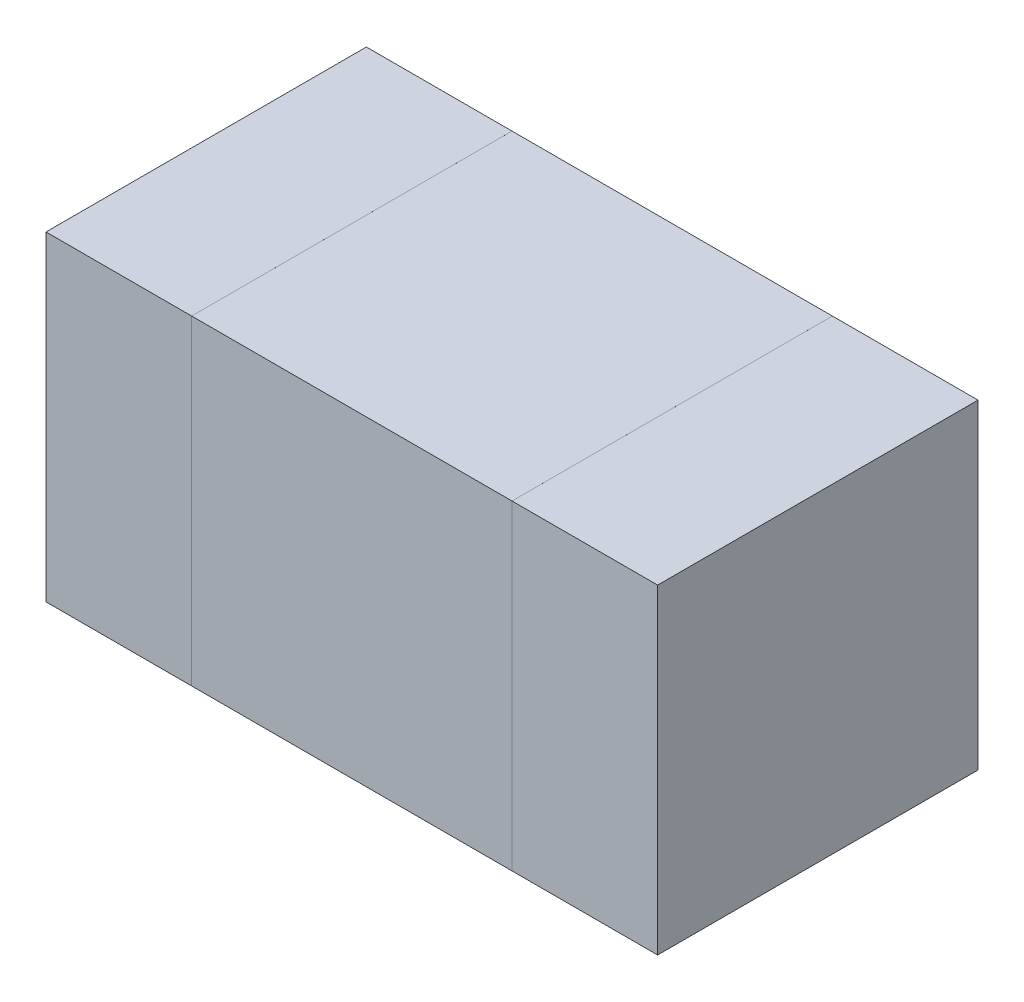
ISO-10303-21;
HEADER;
FILE_DESCRIPTION(('STEP AP214'),'2;1');
FILE_NAME('part.step','',(''),(''),'','','');
FILE_SCHEMA(('AUTOMOTIVE_DESIGN { 1 0 10303 214 1 1 1 1 }'));
ENDSEC;
DATA;
#1=APPLICATION_CONTEXT('core data for automotive mechanical design processes');
#2=APPLICATION_PROTOCOL_DEFINITION('international standard','automotive_design',2000,#1);
#3=PRODUCT_CONTEXT('',#1,'mechanical');
#4=PRODUCT('Part','Part','',(#3));
#5=PRODUCT_RELATED_PRODUCT_CATEGORY('part','',(#4));
#6=PRODUCT_DEFINITION_FORMATION('','',#4);
#7=PRODUCT_DEFINITION_CONTEXT('part definition',#1,'design');
#8=PRODUCT_DEFINITION('design','',#6,#7);
#9=PRODUCT_DEFINITION_SHAPE('','',#8);
#10=(LENGTH_UNIT() NAMED_UNIT(*) SI_UNIT(.MILLI.,.METRE.));
#11=(NAMED_UNIT(*) PLANE_ANGLE_UNIT() SI_UNIT($,.RADIAN.));
#12=(NAMED_UNIT(*) SI_UNIT($,.STERADIAN.) SOLID_ANGLE_UNIT());
#13=UNCERTAINTY_MEASURE_WITH_UNIT(LENGTH_MEASURE(1.E-05),#10,'distance_accuracy_value','');
#14=(GEOMETRIC_REPRESENTATION_CONTEXT(3) GLOBAL_UNCERTAINTY_ASSIGNED_CONTEXT((#13)) GLOBAL_UNIT_ASSIGNED_CONTEXT((#10,
#11,#12)) REPRESENTATION_CONTEXT('',''));
#15=CARTESIAN_POINT('',(0.,0.,0.));
#16=DIRECTION('',(0.,0.,1.));
#17=DIRECTION('',(1.,0.,0.));
#18=AXIS2_PLACEMENT_3D('',#15,#16,#17);
#19=CARTESIAN_POINT('',(0.984990592773,6.634998946074,0.32999934));
#20=DIRECTION('',(0.,0.,-1.));
#21=DIRECTION('',(0.,-1.,0.));
#22=AXIS2_PLACEMENT_3D('',#19,#20,#21);
#23=PLANE('',#22);
#24=DIRECTION('',(0.,1.,0.));
#25=VECTOR('',#24,1.);
#26=CARTESIAN_POINT('',(0.984990592773,6.634998946074,0.32999934));
#27=LINE('',#26,#25);
#28=CARTESIAN_POINT('',(0.984990592773,6.634998946074,0.32999934));
#29=VERTEX_POINT('',#28);
#30=CARTESIAN_POINT('',(0.984990592773,6.965000826074,0.32999934));
#31=VERTEX_POINT('',#30);
#32=EDGE_CURVE('P0_E80',#29,#31,#27,.T.);
#33=ORIENTED_EDGE('',*,*,#32,.T.);
#34=DIRECTION('',(-1.,0.,0.));
#35=VECTOR('',#34,1.);
#36=CARTESIAN_POINT('',(0.984990592773,6.965000826074,0.32999934));
#37=LINE('',#36,#35);
#38=CARTESIAN_POINT('',(0.834988352773,6.965000826074,0.32999934));
#39=VERTEX_POINT('',#38);
#40=EDGE_CURVE('P0_E102',#31,#39,#37,.T.);
#41=ORIENTED_EDGE('',*,*,#40,.T.);
#42=DIRECTION('',(0.,-1.,0.));
#43=VECTOR('',#42,1.);
#44=CARTESIAN_POINT('',(0.834988352773,6.965000826074,0.32999934));
#45=LINE('',#44,#43);
#46=CARTESIAN_POINT('',(0.834988352773,6.634998946074,0.32999934));
#47=VERTEX_POINT('',#46);
#48=EDGE_CURVE('P0_E73',#39,#47,#45,.T.);
#49=ORIENTED_EDGE('',*,*,#48,.T.);
#50=DIRECTION('',(1.,0.,0.));
#51=VECTOR('',#50,1.);
#52=CARTESIAN_POINT('',(0.834988352773,6.634998946074,0.32999934));
#53=LINE('',#52,#51);
#54=EDGE_CURVE('P0_E11',#47,#29,#53,.T.);
#55=ORIENTED_EDGE('',*,*,#54,.T.);
#56=EDGE_LOOP('',(#33,#41,#49,#55));
#57=FACE_BOUND('',#56,.T.);
#58=ADVANCED_FACE('P0_F17',(#57),#23,.F.);
#59=CARTESIAN_POINT('',(0.984990592773,6.634998946074,0.));
#60=DIRECTION('',(0.,0.,-1.));
#61=DIRECTION('',(0.,-1.,0.));
#62=AXIS2_PLACEMENT_3D('',#59,#60,#61);
#63=PLANE('',#62);
#64=DIRECTION('',(1.,0.,0.));
#65=VECTOR('',#64,1.);
#66=CARTESIAN_POINT('',(0.834988352773,6.634998946074,0.));
#67=LINE('',#66,#65);
#68=CARTESIAN_POINT('',(0.834988352773,6.634998946074,0.));
#69=VERTEX_POINT('',#68);
#70=CARTESIAN_POINT('',(0.984990592773,6.634998946074,0.));
#71=VERTEX_POINT('',#70);
#72=EDGE_CURVE('P0_E20',#69,#71,#67,.T.);
#73=ORIENTED_EDGE('',*,*,#72,.F.);
#74=DIRECTION('',(0.,-1.,0.));
#75=VECTOR('',#74,1.);
#76=CARTESIAN_POINT('',(0.834988352773,6.965000826074,0.));
#77=LINE('',#76,#75);
#78=CARTESIAN_POINT('',(0.834988352773,6.965000826074,0.));
#79=VERTEX_POINT('',#78);
#80=EDGE_CURVE('P0_E106',#79,#69,#77,.T.);
#81=ORIENTED_EDGE('',*,*,#80,.F.);
#82=DIRECTION('',(-1.,0.,0.));
#83=VECTOR('',#82,1.);
#84=CARTESIAN_POINT('',(0.984990592773,6.965000826074,0.));
#85=LINE('',#84,#83);
#86=CARTESIAN_POINT('',(0.984990592773,6.965000826074,0.));
#87=VERTEX_POINT('',#86);
#88=EDGE_CURVE('P0_E82',#87,#79,#85,.T.);
#89=ORIENTED_EDGE('',*,*,#88,.F.);
#90=DIRECTION('',(0.,1.,0.));
#91=VECTOR('',#90,1.);
#92=CARTESIAN_POINT('',(0.984990592773,6.634998946074,0.));
#93=LINE('',#92,#91);
#94=EDGE_CURVE('P0_E78',#71,#87,#93,.T.);
#95=ORIENTED_EDGE('',*,*,#94,.F.);
#96=EDGE_LOOP('',(#73,#81,#89,#95));
#97=FACE_BOUND('',#96,.T.);
#98=ADVANCED_FACE('P0_F84',(#97),#63,.T.);
#99=CARTESIAN_POINT('',(0.834988352773,6.634998946074,0.));
#100=DIRECTION('',(0.,1.,0.));
#101=DIRECTION('',(1.,0.,0.));
#102=AXIS2_PLACEMENT_3D('',#99,#100,#101);
#103=PLANE('',#102);
#104=ORIENTED_EDGE('',*,*,#72,.T.);
#105=DIRECTION('',(0.,0.,1.));
#106=VECTOR('',#105,1.);
#107=CARTESIAN_POINT('',(0.984990592773,6.634998946074,0.));
#108=LINE('',#107,#106);
#109=EDGE_CURVE('P0_E65',#71,#29,#108,.T.);
#110=ORIENTED_EDGE('',*,*,#109,.T.);
#111=ORIENTED_EDGE('',*,*,#54,.F.);
#112=DIRECTION('',(0.,0.,1.));
#113=VECTOR('',#112,1.);
#114=CARTESIAN_POINT('',(0.834988352773,6.634998946074,0.));
#115=LINE('',#114,#113);
#116=EDGE_CURVE('P0_E68',#69,#47,#115,.T.);
#117=ORIENTED_EDGE('',*,*,#116,.F.);
#118=EDGE_LOOP('',(#104,#110,#111,#117));
#119=FACE_BOUND('',#118,.T.);
#120=ADVANCED_FACE('P0_F64',(#119),#103,.F.);
#121=CARTESIAN_POINT('',(0.834988352773,6.965000826074,0.));
#122=DIRECTION('',(1.,0.,0.));
#123=DIRECTION('',(0.,1.,0.));
#124=AXIS2_PLACEMENT_3D('',#121,#122,#123);
#125=PLANE('',#124);
#126=ORIENTED_EDGE('',*,*,#80,.T.);
#127=ORIENTED_EDGE('',*,*,#116,.T.);
#128=ORIENTED_EDGE('',*,*,#48,.F.);
#129=DIRECTION('',(0.,0.,1.));
#130=VECTOR('',#129,1.);
#131=CARTESIAN_POINT('',(0.834988352773,6.965000826074,0.));
#132=LINE('',#131,#130);
#133=EDGE_CURVE('P0_E97',#79,#39,#132,.T.);
#134=ORIENTED_EDGE('',*,*,#133,.F.);
#135=EDGE_LOOP('',(#126,#127,#128,#134));
#136=FACE_BOUND('',#135,.T.);
#137=ADVANCED_FACE('P0_F115',(#136),#125,.F.);
#138=CARTESIAN_POINT('',(0.984990592773,6.965000826074,0.));
#139=DIRECTION('',(0.,-1.,0.));
#140=DIRECTION('',(0.,0.,-1.));
#141=AXIS2_PLACEMENT_3D('',#138,#139,#140);
#142=PLANE('',#141);
#143=ORIENTED_EDGE('',*,*,#88,.T.);
#144=ORIENTED_EDGE('',*,*,#133,.T.);
#145=ORIENTED_EDGE('',*,*,#40,.F.);
#146=DIRECTION('',(0.,0.,1.));
#147=VECTOR('',#146,1.);
#148=CARTESIAN_POINT('',(0.984990592773,6.965000826074,0.));
#149=LINE('',#148,#147);
#150=EDGE_CURVE('P0_E88',#87,#31,#149,.T.);
#151=ORIENTED_EDGE('',*,*,#150,.F.);
#152=EDGE_LOOP('',(#143,#144,#145,#151));
#153=FACE_BOUND('',#152,.T.);
#154=ADVANCED_FACE('P0_F117',(#153),#142,.F.);
#155=CARTESIAN_POINT('',(0.984990592773,6.634998946074,0.));
#156=DIRECTION('',(-1.,0.,0.));
#157=DIRECTION('',(0.,0.,1.));
#158=AXIS2_PLACEMENT_3D('',#155,#156,#157);
#159=PLANE('',#158);
#160=ORIENTED_EDGE('',*,*,#94,.T.);
#161=ORIENTED_EDGE('',*,*,#150,.T.);
#162=ORIENTED_EDGE('',*,*,#32,.F.);
#163=ORIENTED_EDGE('',*,*,#109,.F.);
#164=EDGE_LOOP('',(#160,#161,#162,#163));
#165=FACE_BOUND('',#164,.T.);
#166=ADVANCED_FACE('P0_F76',(#165),#159,.F.);
#167=CLOSED_SHELL('',(#58,#98,#120,#137,#154,#166));
#168=MANIFOLD_SOLID_BREP('P0_B1',#167);
#169=CARTESIAN_POINT('',(1.465001579102,6.634998946074,0.32999934));
#170=DIRECTION('',(0.,0.,-1.));
#171=DIRECTION('',(0.,-1.,0.));
#172=AXIS2_PLACEMENT_3D('',#169,#170,#171);
#173=PLANE('',#172);
#174=DIRECTION('',(0.,1.,0.));
#175=VECTOR('',#174,1.);
#176=CARTESIAN_POINT('',(1.465001579102,6.634998946074,0.32999934));
#177=LINE('',#176,#175);
#178=CARTESIAN_POINT('',(1.465001579102,6.634998946074,0.32999934));
#179=VERTEX_POINT('',#178);
#180=CARTESIAN_POINT('',(1.465001579102,6.965000826074,0.32999934));
#181=VERTEX_POINT('',#180);
#182=EDGE_CURVE('P1_E84',#179,#181,#177,.T.);
#183=ORIENTED_EDGE('',*,*,#182,.T.);
#184=DIRECTION('',(-1.,0.,0.));
#185=VECTOR('',#184,1.);
#186=CARTESIAN_POINT('',(1.465001579102,6.965000826074,0.32999934));
#187=LINE('',#186,#185);
#188=CARTESIAN_POINT('',(1.314999339102,6.965000826074,0.32999934));
#189=VERTEX_POINT('',#188);
#190=EDGE_CURVE('P1_E70',#181,#189,#187,.T.);
#191=ORIENTED_EDGE('',*,*,#190,.T.);
#192=DIRECTION('',(0.,-1.,0.));
#193=VECTOR('',#192,1.);
#194=CARTESIAN_POINT('',(1.314999339102,6.965000826074,0.32999934));
#195=LINE('',#194,#193);
#196=CARTESIAN_POINT('',(1.314999339102,6.634998946074,0.32999934));
#197=VERTEX_POINT('',#196);
#198=EDGE_CURVE('P1_E111',#189,#197,#195,.T.);
#199=ORIENTED_EDGE('',*,*,#198,.T.);
#200=DIRECTION('',(1.,0.,0.));
#201=VECTOR('',#200,1.);
#202=CARTESIAN_POINT('',(1.314999339102,6.634998946074,0.32999934));
#203=LINE('',#202,#201);
#204=EDGE_CURVE('P1_E11',#197,#179,#203,.T.);
#205=ORIENTED_EDGE('',*,*,#204,.T.);
#206=EDGE_LOOP('',(#183,#191,#199,#205));
#207=FACE_BOUND('',#206,.T.);
#208=ADVANCED_FACE('P1_F17',(#207),#173,.F.);
#209=CARTESIAN_POINT('',(1.465001579102,6.634998946074,0.));
#210=DIRECTION('',(0.,0.,-1.));
#211=DIRECTION('',(0.,-1.,0.));
#212=AXIS2_PLACEMENT_3D('',#209,#210,#211);
#213=PLANE('',#212);
#214=DIRECTION('',(1.,0.,0.));
#215=VECTOR('',#214,1.);
#216=CARTESIAN_POINT('',(1.314999339102,6.634998946074,0.));
#217=LINE('',#216,#215);
#218=CARTESIAN_POINT('',(1.314999339102,6.634998946074,0.));
#219=VERTEX_POINT('',#218);
#220=CARTESIAN_POINT('',(1.465001579102,6.634998946074,0.));
#221=VERTEX_POINT('',#220);
#222=EDGE_CURVE('P1_E25',#219,#221,#217,.T.);
#223=ORIENTED_EDGE('',*,*,#222,.F.);
#224=DIRECTION('',(0.,-1.,0.));
#225=VECTOR('',#224,1.);
#226=CARTESIAN_POINT('',(1.314999339102,6.965000826074,0.));
#227=LINE('',#226,#225);
#228=CARTESIAN_POINT('',(1.314999339102,6.965000826074,0.));
#229=VERTEX_POINT('',#228);
#230=EDGE_CURVE('P1_E81',#229,#219,#227,.T.);
#231=ORIENTED_EDGE('',*,*,#230,.F.);
#232=DIRECTION('',(-1.,0.,0.));
#233=VECTOR('',#232,1.);
#234=CARTESIAN_POINT('',(1.465001579102,6.965000826074,0.));
#235=LINE('',#234,#233);
#236=CARTESIAN_POINT('',(1.465001579102,6.965000826074,0.));
#237=VERTEX_POINT('',#236);
#238=EDGE_CURVE('P1_E106',#237,#229,#235,.T.);
#239=ORIENTED_EDGE('',*,*,#238,.F.);
#240=DIRECTION('',(0.,1.,0.));
#241=VECTOR('',#240,1.);
#242=CARTESIAN_POINT('',(1.465001579102,6.634998946074,0.));
#243=LINE('',#242,#241);
#244=EDGE_CURVE('P1_E91',#221,#237,#243,.T.);
#245=ORIENTED_EDGE('',*,*,#244,.F.);
#246=EDGE_LOOP('',(#223,#231,#239,#245));
#247=FACE_BOUND('',#246,.T.);
#248=ADVANCED_FACE('P1_F116',(#247),#213,.T.);
#249=CARTESIAN_POINT('',(1.314999339102,6.634998946074,0.));
#250=DIRECTION('',(0.,1.,0.));
#251=DIRECTION('',(1.,0.,0.));
#252=AXIS2_PLACEMENT_3D('',#249,#250,#251);
#253=PLANE('',#252);
#254=ORIENTED_EDGE('',*,*,#222,.T.);
#255=DIRECTION('',(0.,0.,1.));
#256=VECTOR('',#255,1.);
#257=CARTESIAN_POINT('',(1.465001579102,6.634998946074,0.));
#258=LINE('',#257,#256);
#259=EDGE_CURVE('P1_E88',#221,#179,#258,.T.);
#260=ORIENTED_EDGE('',*,*,#259,.T.);
#261=ORIENTED_EDGE('',*,*,#204,.F.);
#262=DIRECTION('',(0.,0.,1.));
#263=VECTOR('',#262,1.);
#264=CARTESIAN_POINT('',(1.314999339102,6.634998946074,0.));
#265=LINE('',#264,#263);
#266=EDGE_CURVE('P1_E103',#219,#197,#265,.T.);
#267=ORIENTED_EDGE('',*,*,#266,.F.);
#268=EDGE_LOOP('',(#254,#260,#261,#267));
#269=FACE_BOUND('',#268,.T.);
#270=ADVANCED_FACE('P1_F115',(#269),#253,.F.);
#271=CARTESIAN_POINT('',(1.314999339102,6.965000826074,0.));
#272=DIRECTION('',(1.,0.,0.));
#273=DIRECTION('',(0.,1.,0.));
#274=AXIS2_PLACEMENT_3D('',#271,#272,#273);
#275=PLANE('',#274);
#276=ORIENTED_EDGE('',*,*,#230,.T.);
#277=ORIENTED_EDGE('',*,*,#266,.T.);
#278=ORIENTED_EDGE('',*,*,#198,.F.);
#279=DIRECTION('',(0.,0.,1.));
#280=VECTOR('',#279,1.);
#281=CARTESIAN_POINT('',(1.314999339102,6.965000826074,0.));
#282=LINE('',#281,#280);
#283=EDGE_CURVE('P1_E78',#229,#189,#282,.T.);
#284=ORIENTED_EDGE('',*,*,#283,.F.);
#285=EDGE_LOOP('',(#276,#277,#278,#284));
#286=FACE_BOUND('',#285,.T.);
#287=ADVANCED_FACE('P1_F118',(#286),#275,.F.);
#288=CARTESIAN_POINT('',(1.465001579102,6.965000826074,0.));
#289=DIRECTION('',(0.,-1.,0.));
#290=DIRECTION('',(0.,0.,-1.));
#291=AXIS2_PLACEMENT_3D('',#288,#289,#290);
#292=PLANE('',#291);
#293=ORIENTED_EDGE('',*,*,#238,.T.);
#294=ORIENTED_EDGE('',*,*,#283,.T.);
#295=ORIENTED_EDGE('',*,*,#190,.F.);
#296=DIRECTION('',(0.,0.,1.));
#297=VECTOR('',#296,1.);
#298=CARTESIAN_POINT('',(1.465001579102,6.965000826074,0.));
#299=LINE('',#298,#297);
#300=EDGE_CURVE('P1_E75',#237,#181,#299,.T.);
#301=ORIENTED_EDGE('',*,*,#300,.F.);
#302=EDGE_LOOP('',(#293,#294,#295,#301));
#303=FACE_BOUND('',#302,.T.);
#304=ADVANCED_FACE('P1_F73',(#303),#292,.F.);
#305=CARTESIAN_POINT('',(1.465001579102,6.634998946074,0.));
#306=DIRECTION('',(-1.,0.,0.));
#307=DIRECTION('',(0.,0.,1.));
#308=AXIS2_PLACEMENT_3D('',#305,#306,#307);
#309=PLANE('',#308);
#310=ORIENTED_EDGE('',*,*,#244,.T.);
#311=ORIENTED_EDGE('',*,*,#300,.T.);
#312=ORIENTED_EDGE('',*,*,#182,.F.);
#313=ORIENTED_EDGE('',*,*,#259,.F.);
#314=EDGE_LOOP('',(#310,#311,#312,#313));
#315=FACE_BOUND('',#314,.T.);
#316=ADVANCED_FACE('P1_F90',(#315),#309,.F.);
#317=CLOSED_SHELL('',(#208,#248,#270,#287,#304,#316));
#318=MANIFOLD_SOLID_BREP('P1_B1',#317);
#319=CARTESIAN_POINT('',(0.984994025938,6.635001486074,0.32999934));
#320=DIRECTION('',(0.,0.,-1.));
#321=DIRECTION('',(0.,-1.,0.));
#322=AXIS2_PLACEMENT_3D('',#319,#320,#321);
#323=PLANE('',#322);
#324=DIRECTION('',(1.,0.,0.));
#325=VECTOR('',#324,1.);
#326=CARTESIAN_POINT('',(0.984994025938,6.635001486074,0.32999934));
#327=LINE('',#326,#325);
#328=CARTESIAN_POINT('',(0.984994025938,6.635001486074,0.32999934));
#329=VERTEX_POINT('',#328);
#330=CARTESIAN_POINT('',(1.314995905938,6.635001486074,0.32999934));
#331=VERTEX_POINT('',#330);
#332=EDGE_CURVE('P2_E82',#329,#331,#327,.T.);
#333=ORIENTED_EDGE('',*,*,#332,.T.);
#334=DIRECTION('',(0.,1.,0.));
#335=VECTOR('',#334,1.);
#336=CARTESIAN_POINT('',(1.314995905938,6.635001486074,0.32999934));
#337=LINE('',#336,#335);
#338=CARTESIAN_POINT('',(1.314995905938,6.965000826074,0.32999934));
#339=VERTEX_POINT('',#338);
#340=EDGE_CURVE('P2_E104',#331,#339,#337,.T.);
#341=ORIENTED_EDGE('',*,*,#340,.T.);
#342=DIRECTION('',(-1.,0.,0.));
#343=VECTOR('',#342,1.);
#344=CARTESIAN_POINT('',(1.314995905938,6.965000826074,0.32999934));
#345=LINE('',#344,#343);
#346=CARTESIAN_POINT('',(0.984994025938,6.965000826074,0.32999934));
#347=VERTEX_POINT('',#346);
#348=EDGE_CURVE('P2_E74',#339,#347,#345,.T.);
#349=ORIENTED_EDGE('',*,*,#348,.T.);
#350=DIRECTION('',(0.,-1.,0.));
#351=VECTOR('',#350,1.);
#352=CARTESIAN_POINT('',(0.984994025938,6.965000826074,0.32999934));
#353=LINE('',#352,#351);
#354=EDGE_CURVE('P2_E11',#347,#329,#353,.T.);
#355=ORIENTED_EDGE('',*,*,#354,.T.);
#356=EDGE_LOOP('',(#333,#341,#349,#355));
#357=FACE_BOUND('',#356,.T.);
#358=ADVANCED_FACE('P2_F17',(#357),#323,.F.);
#359=CARTESIAN_POINT('',(0.984994025938,6.635001486074,0.));
#360=DIRECTION('',(0.,0.,-1.));
#361=DIRECTION('',(0.,-1.,0.));
#362=AXIS2_PLACEMENT_3D('',#359,#360,#361);
#363=PLANE('',#362);
#364=DIRECTION('',(0.,-1.,0.));
#365=VECTOR('',#364,1.);
#366=CARTESIAN_POINT('',(0.984994025938,6.965000826074,0.));
#367=LINE('',#366,#365);
#368=CARTESIAN_POINT('',(0.984994025938,6.965000826074,0.));
#369=VERTEX_POINT('',#368);
#370=CARTESIAN_POINT('',(0.984994025938,6.635001486074,0.));
#371=VERTEX_POINT('',#370);
#372=EDGE_CURVE('P2_E25',#369,#371,#367,.T.);
#373=ORIENTED_EDGE('',*,*,#372,.F.);
#374=DIRECTION('',(-1.,0.,0.));
#375=VECTOR('',#374,1.);
#376=CARTESIAN_POINT('',(1.314995905938,6.965000826074,0.));
#377=LINE('',#376,#375);
#378=CARTESIAN_POINT('',(1.314995905938,6.965000826074,0.));
#379=VERTEX_POINT('',#378);
#380=EDGE_CURVE('P2_E100',#379,#369,#377,.T.);
#381=ORIENTED_EDGE('',*,*,#380,.F.);
#382=DIRECTION('',(0.,1.,0.));
#383=VECTOR('',#382,1.);
#384=CARTESIAN_POINT('',(1.314995905938,6.635001486074,0.));
#385=LINE('',#384,#383);
#386=CARTESIAN_POINT('',(1.314995905938,6.635001486074,0.));
#387=VERTEX_POINT('',#386);
#388=EDGE_CURVE('P2_E84',#387,#379,#385,.T.);
#389=ORIENTED_EDGE('',*,*,#388,.F.);
#390=DIRECTION('',(1.,0.,0.));
#391=VECTOR('',#390,1.);
#392=CARTESIAN_POINT('',(0.984994025938,6.635001486074,0.));
#393=LINE('',#392,#391);
#394=EDGE_CURVE('P2_E80',#371,#387,#393,.T.);
#395=ORIENTED_EDGE('',*,*,#394,.F.);
#396=EDGE_LOOP('',(#373,#381,#389,#395));
#397=FACE_BOUND('',#396,.T.);
#398=ADVANCED_FACE('P2_F86',(#397),#363,.T.);
#399=CARTESIAN_POINT('',(0.984994025938,6.965000826074,0.));
#400=DIRECTION('',(1.,0.,0.));
#401=DIRECTION('',(0.,1.,0.));
#402=AXIS2_PLACEMENT_3D('',#399,#400,#401);
#403=PLANE('',#402);
#404=ORIENTED_EDGE('',*,*,#372,.T.);
#405=DIRECTION('',(0.,0.,1.));
#406=VECTOR('',#405,1.);
#407=CARTESIAN_POINT('',(0.984994025938,6.635001486074,0.));
#408=LINE('',#407,#406);
#409=EDGE_CURVE('P2_E68',#371,#329,#408,.T.);
#410=ORIENTED_EDGE('',*,*,#409,.T.);
#411=ORIENTED_EDGE('',*,*,#354,.F.);
#412=DIRECTION('',(0.,0.,1.));
#413=VECTOR('',#412,1.);
#414=CARTESIAN_POINT('',(0.984994025938,6.965000826074,0.));
#415=LINE('',#414,#413);
#416=EDGE_CURVE('P2_E71',#369,#347,#415,.T.);
#417=ORIENTED_EDGE('',*,*,#416,.F.);
#418=EDGE_LOOP('',(#404,#410,#411,#417));
#419=FACE_BOUND('',#418,.T.);
#420=ADVANCED_FACE('P2_F67',(#419),#403,.F.);
#421=CARTESIAN_POINT('',(1.314995905938,6.965000826074,0.));
#422=DIRECTION('',(0.,-1.,0.));
#423=DIRECTION('',(0.,0.,-1.));
#424=AXIS2_PLACEMENT_3D('',#421,#422,#423);
#425=PLANE('',#424);
#426=ORIENTED_EDGE('',*,*,#380,.T.);
#427=ORIENTED_EDGE('',*,*,#416,.T.);
#428=ORIENTED_EDGE('',*,*,#348,.F.);
#429=DIRECTION('',(0.,0.,1.));
#430=VECTOR('',#429,1.);
#431=CARTESIAN_POINT('',(1.314995905938,6.965000826074,0.));
#432=LINE('',#431,#430);
#433=EDGE_CURVE('P2_E103',#379,#339,#432,.T.);
#434=ORIENTED_EDGE('',*,*,#433,.F.);
#435=EDGE_LOOP('',(#426,#427,#428,#434));
#436=FACE_BOUND('',#435,.T.);
#437=ADVANCED_FACE('P2_F117',(#436),#425,.F.);
#438=CARTESIAN_POINT('',(1.314995905938,6.635001486074,0.));
#439=DIRECTION('',(-1.,0.,0.));
#440=DIRECTION('',(0.,0.,1.));
#441=AXIS2_PLACEMENT_3D('',#438,#439,#440);
#442=PLANE('',#441);
#443=ORIENTED_EDGE('',*,*,#388,.T.);
#444=ORIENTED_EDGE('',*,*,#433,.T.);
#445=ORIENTED_EDGE('',*,*,#340,.F.);
#446=DIRECTION('',(0.,0.,1.));
#447=VECTOR('',#446,1.);
#448=CARTESIAN_POINT('',(1.314995905938,6.635001486074,0.));
#449=LINE('',#448,#447);
#450=EDGE_CURVE('P2_E90',#387,#331,#449,.T.);
#451=ORIENTED_EDGE('',*,*,#450,.F.);
#452=EDGE_LOOP('',(#443,#444,#445,#451));
#453=FACE_BOUND('',#452,.T.);
#454=ADVANCED_FACE('P2_F119',(#453),#442,.F.);
#455=CARTESIAN_POINT('',(0.984994025938,6.635001486074,0.));
#456=DIRECTION('',(0.,1.,0.));
#457=DIRECTION('',(1.,0.,0.));
#458=AXIS2_PLACEMENT_3D('',#455,#456,#457);
#459=PLANE('',#458);
#460=ORIENTED_EDGE('',*,*,#394,.T.);
#461=ORIENTED_EDGE('',*,*,#450,.T.);
#462=ORIENTED_EDGE('',*,*,#332,.F.);
#463=ORIENTED_EDGE('',*,*,#409,.F.);
#464=EDGE_LOOP('',(#460,#461,#462,#463));
#465=FACE_BOUND('',#464,.T.);
#466=ADVANCED_FACE('P2_F78',(#465),#459,.F.);
#467=CLOSED_SHELL('',(#358,#398,#420,#437,#454,#466));
#468=MANIFOLD_SOLID_BREP('P2_B1',#467);
#469=ADVANCED_BREP_SHAPE_REPRESENTATION('',(#18,#168,#318,#468),#14);
#470=SHAPE_DEFINITION_REPRESENTATION(#9,#469);
ENDSEC;
END-ISO-10303-21;
